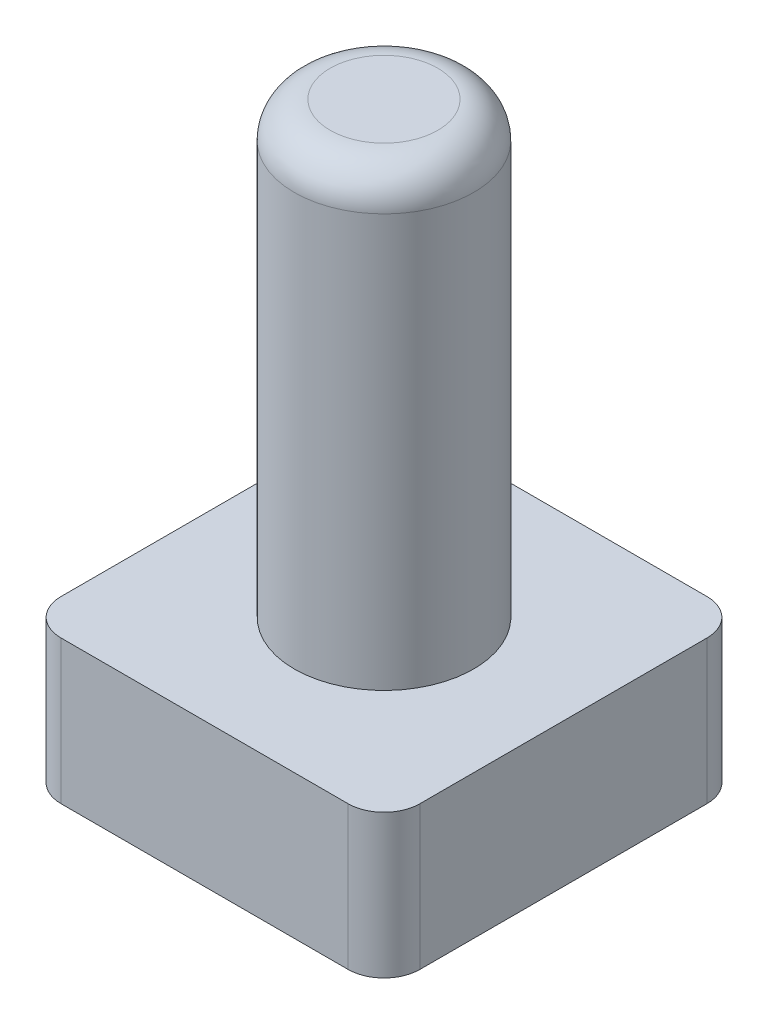
ISO-10303-21;
HEADER;
FILE_DESCRIPTION(('STEP AP214'),'2;1');
FILE_NAME('part.step','',(''),(''),'','','');
FILE_SCHEMA(('AUTOMOTIVE_DESIGN { 1 0 10303 214 1 1 1 1 }'));
ENDSEC;
DATA;
#1=APPLICATION_CONTEXT('core data for automotive mechanical design processes');
#2=APPLICATION_PROTOCOL_DEFINITION('international standard','automotive_design',2000,#1);
#3=PRODUCT_CONTEXT('',#1,'mechanical');
#4=PRODUCT('Part','Part','',(#3));
#5=PRODUCT_RELATED_PRODUCT_CATEGORY('part','',(#4));
#6=PRODUCT_DEFINITION_FORMATION('','',#4);
#7=PRODUCT_DEFINITION_CONTEXT('part definition',#1,'design');
#8=PRODUCT_DEFINITION('design','',#6,#7);
#9=PRODUCT_DEFINITION_SHAPE('','',#8);
#10=(LENGTH_UNIT() NAMED_UNIT(*) SI_UNIT(.MILLI.,.METRE.));
#11=(NAMED_UNIT(*) PLANE_ANGLE_UNIT() SI_UNIT($,.RADIAN.));
#12=(NAMED_UNIT(*) SI_UNIT($,.STERADIAN.) SOLID_ANGLE_UNIT());
#13=UNCERTAINTY_MEASURE_WITH_UNIT(LENGTH_MEASURE(1.E-05),#10,'distance_accuracy_value','');
#14=(GEOMETRIC_REPRESENTATION_CONTEXT(3) GLOBAL_UNCERTAINTY_ASSIGNED_CONTEXT((#13)) GLOBAL_UNIT_ASSIGNED_CONTEXT((#10,
#11,#12)) REPRESENTATION_CONTEXT('',''));
#15=CARTESIAN_POINT('',(0.,0.,0.));
#16=DIRECTION('',(0.,0.,1.));
#17=DIRECTION('',(1.,0.,0.));
#18=AXIS2_PLACEMENT_3D('',#15,#16,#17);
#19=CARTESIAN_POINT('',(0.,0.,0.));
#20=DIRECTION('',(0.,-1.,0.));
#21=DIRECTION('',(0.,0.,-1.));
#22=AXIS2_PLACEMENT_3D('',#19,#20,#21);
#23=PLANE('',#22);
#24=DIRECTION('',(0.,0.,1.));
#25=VECTOR('',#24,1.);
#26=CARTESIAN_POINT('',(0.,0.,0.));
#27=LINE('',#26,#25);
#28=CARTESIAN_POINT('',(0.,0.,-9.));
#29=VERTEX_POINT('',#28);
#30=CARTESIAN_POINT('',(0.,0.,-1.));
#31=VERTEX_POINT('',#30);
#32=EDGE_CURVE('E157',#29,#31,#27,.T.);
#33=ORIENTED_EDGE('',*,*,#32,.F.);
#34=CARTESIAN_POINT('',(1.,0.,-9.));
#35=DIRECTION('',(0.,-1.,0.));
#36=DIRECTION('',(0.,0.,-1.));
#37=AXIS2_PLACEMENT_3D('',#34,#35,#36);
#38=CIRCLE('',#37,1.);
#39=CARTESIAN_POINT('',(1.,0.,-10.));
#40=VERTEX_POINT('',#39);
#41=EDGE_CURVE('E196',#29,#40,#38,.T.);
#42=ORIENTED_EDGE('',*,*,#41,.T.);
#43=DIRECTION('',(-1.,0.,0.));
#44=VECTOR('',#43,1.);
#45=CARTESIAN_POINT('',(0.,0.,-10.));
#46=LINE('',#45,#44);
#47=CARTESIAN_POINT('',(9.,0.,-10.));
#48=VERTEX_POINT('',#47);
#49=EDGE_CURVE('E175',#48,#40,#46,.T.);
#50=ORIENTED_EDGE('',*,*,#49,.F.);
#51=CARTESIAN_POINT('',(9.,0.,-9.));
#52=DIRECTION('',(0.,-1.,0.));
#53=DIRECTION('',(0.,0.,-1.));
#54=AXIS2_PLACEMENT_3D('',#51,#52,#53);
#55=CIRCLE('',#54,1.);
#56=CARTESIAN_POINT('',(10.,0.,-9.));
#57=VERTEX_POINT('',#56);
#58=EDGE_CURVE('E193',#48,#57,#55,.T.);
#59=ORIENTED_EDGE('',*,*,#58,.T.);
#60=DIRECTION('',(0.,0.,-1.));
#61=VECTOR('',#60,1.);
#62=CARTESIAN_POINT('',(10.,0.,0.));
#63=LINE('',#62,#61);
#64=CARTESIAN_POINT('',(10.,0.,-1.));
#65=VERTEX_POINT('',#64);
#66=EDGE_CURVE('E172',#65,#57,#63,.T.);
#67=ORIENTED_EDGE('',*,*,#66,.F.);
#68=CARTESIAN_POINT('',(9.,0.,-1.));
#69=DIRECTION('',(0.,-1.,0.));
#70=DIRECTION('',(0.,0.,-1.));
#71=AXIS2_PLACEMENT_3D('',#68,#69,#70);
#72=CIRCLE('',#71,1.);
#73=CARTESIAN_POINT('',(9.,0.,0.));
#74=VERTEX_POINT('',#73);
#75=EDGE_CURVE('E190',#65,#74,#72,.T.);
#76=ORIENTED_EDGE('',*,*,#75,.T.);
#77=DIRECTION('',(1.,0.,0.));
#78=VECTOR('',#77,1.);
#79=CARTESIAN_POINT('',(0.,0.,0.));
#80=LINE('',#79,#78);
#81=CARTESIAN_POINT('',(1.,0.,0.));
#82=VERTEX_POINT('',#81);
#83=EDGE_CURVE('E163',#82,#74,#80,.T.);
#84=ORIENTED_EDGE('',*,*,#83,.F.);
#85=CARTESIAN_POINT('',(1.,0.,-1.));
#86=DIRECTION('',(0.,-1.,0.));
#87=DIRECTION('',(0.,0.,-1.));
#88=AXIS2_PLACEMENT_3D('',#85,#86,#87);
#89=CIRCLE('',#88,1.);
#90=EDGE_CURVE('E187',#82,#31,#89,.T.);
#91=ORIENTED_EDGE('',*,*,#90,.T.);
#92=EDGE_LOOP('',(#33,#42,#50,#59,#67,#76,#84,#91));
#93=FACE_BOUND('',#92,.T.);
#94=DIRECTION('',(-1.,0.,0.));
#95=VECTOR('',#94,1.);
#96=CARTESIAN_POINT('',(1.5,0.,-8.5));
#97=LINE('',#96,#95);
#98=CARTESIAN_POINT('',(8.5,0.,-8.5));
#99=VERTEX_POINT('',#98);
#100=CARTESIAN_POINT('',(1.5,0.,-8.5));
#101=VERTEX_POINT('',#100);
#102=EDGE_CURVE('E151',#99,#101,#97,.T.);
#103=ORIENTED_EDGE('',*,*,#102,.T.);
#104=DIRECTION('',(0.,0.,1.));
#105=VECTOR('',#104,1.);
#106=CARTESIAN_POINT('',(1.5,0.,-1.5));
#107=LINE('',#106,#105);
#108=CARTESIAN_POINT('',(1.5,0.,-1.5));
#109=VERTEX_POINT('',#108);
#110=EDGE_CURVE('E300',#101,#109,#107,.T.);
#111=ORIENTED_EDGE('',*,*,#110,.T.);
#112=DIRECTION('',(1.,0.,0.));
#113=VECTOR('',#112,1.);
#114=CARTESIAN_POINT('',(1.5,0.,-1.5));
#115=LINE('',#114,#113);
#116=CARTESIAN_POINT('',(8.5,0.,-1.5));
#117=VERTEX_POINT('',#116);
#118=EDGE_CURVE('E155',#109,#117,#115,.T.);
#119=ORIENTED_EDGE('',*,*,#118,.T.);
#120=DIRECTION('',(0.,0.,-1.));
#121=VECTOR('',#120,1.);
#122=CARTESIAN_POINT('',(8.5,0.,-1.5));
#123=LINE('',#122,#121);
#124=EDGE_CURVE('E315',#117,#99,#123,.T.);
#125=ORIENTED_EDGE('',*,*,#124,.T.);
#126=EDGE_LOOP('',(#103,#111,#119,#125));
#127=FACE_BOUND('',#126,.T.);
#128=ADVANCED_FACE('F39',(#93,#127),#23,.T.);
#129=CARTESIAN_POINT('',(0.,3.,0.));
#130=DIRECTION('',(1.,0.,0.));
#131=DIRECTION('',(0.,0.,-1.));
#132=AXIS2_PLACEMENT_3D('',#129,#130,#131);
#133=PLANE('',#132);
#134=DIRECTION('',(0.,0.,1.));
#135=VECTOR('',#134,1.);
#136=CARTESIAN_POINT('',(0.,4.,-10.));
#137=LINE('',#136,#135);
#138=CARTESIAN_POINT('',(0.,4.,-9.));
#139=VERTEX_POINT('',#138);
#140=CARTESIAN_POINT('',(0.,4.,-0.999999999999999));
#141=VERTEX_POINT('',#140);
#142=EDGE_CURVE('E295',#139,#141,#137,.T.);
#143=ORIENTED_EDGE('',*,*,#142,.F.);
#144=DIRECTION('',(0.,-1.,0.));
#145=VECTOR('',#144,1.);
#146=CARTESIAN_POINT('',(0.,3.,-9.));
#147=LINE('',#146,#145);
#148=EDGE_CURVE('E183',#139,#29,#147,.T.);
#149=ORIENTED_EDGE('',*,*,#148,.T.);
#150=ORIENTED_EDGE('',*,*,#32,.T.);
#151=DIRECTION('',(0.,-1.,0.));
#152=VECTOR('',#151,1.);
#153=CARTESIAN_POINT('',(0.,3.,-1.));
#154=LINE('',#153,#152);
#155=EDGE_CURVE('E180',#31,#141,#154,.F.);
#156=ORIENTED_EDGE('',*,*,#155,.T.);
#157=EDGE_LOOP('',(#143,#149,#150,#156));
#158=FACE_BOUND('',#157,.T.);
#159=ADVANCED_FACE('F245',(#158),#133,.F.);
#160=CARTESIAN_POINT('',(0.,3.,0.));
#161=DIRECTION('',(0.,0.,-1.));
#162=DIRECTION('',(-1.,0.,0.));
#163=AXIS2_PLACEMENT_3D('',#160,#161,#162);
#164=PLANE('',#163);
#165=ORIENTED_EDGE('',*,*,#83,.T.);
#166=DIRECTION('',(0.,-1.,0.));
#167=VECTOR('',#166,1.);
#168=CARTESIAN_POINT('',(9.,3.,0.));
#169=LINE('',#168,#167);
#170=CARTESIAN_POINT('',(9.,4.,0.));
#171=VERTEX_POINT('',#170);
#172=EDGE_CURVE('E227',#74,#171,#169,.F.);
#173=ORIENTED_EDGE('',*,*,#172,.T.);
#174=DIRECTION('',(1.,0.,0.));
#175=VECTOR('',#174,1.);
#176=CARTESIAN_POINT('',(0.,4.,0.));
#177=LINE('',#176,#175);
#178=CARTESIAN_POINT('',(1.,4.,0.));
#179=VERTEX_POINT('',#178);
#180=EDGE_CURVE('E302',#179,#171,#177,.T.);
#181=ORIENTED_EDGE('',*,*,#180,.F.);
#182=DIRECTION('',(0.,-1.,0.));
#183=VECTOR('',#182,1.);
#184=CARTESIAN_POINT('',(1.,3.,0.));
#185=LINE('',#184,#183);
#186=EDGE_CURVE('E223',#179,#82,#185,.T.);
#187=ORIENTED_EDGE('',*,*,#186,.T.);
#188=EDGE_LOOP('',(#165,#173,#181,#187));
#189=FACE_BOUND('',#188,.T.);
#190=ADVANCED_FACE('F251',(#189),#164,.F.);
#191=CARTESIAN_POINT('',(10.,3.,0.));
#192=DIRECTION('',(-1.,0.,0.));
#193=DIRECTION('',(0.,0.,1.));
#194=AXIS2_PLACEMENT_3D('',#191,#192,#193);
#195=PLANE('',#194);
#196=ORIENTED_EDGE('',*,*,#66,.T.);
#197=DIRECTION('',(0.,-1.,0.));
#198=VECTOR('',#197,1.);
#199=CARTESIAN_POINT('',(10.,3.,-9.));
#200=LINE('',#199,#198);
#201=CARTESIAN_POINT('',(10.,4.,-9.));
#202=VERTEX_POINT('',#201);
#203=EDGE_CURVE('E55',#57,#202,#200,.F.);
#204=ORIENTED_EDGE('',*,*,#203,.T.);
#205=DIRECTION('',(0.,0.,-1.));
#206=VECTOR('',#205,1.);
#207=CARTESIAN_POINT('',(10.,4.,0.));
#208=LINE('',#207,#206);
#209=CARTESIAN_POINT('',(10.,4.,-1.));
#210=VERTEX_POINT('',#209);
#211=EDGE_CURVE('E284',#210,#202,#208,.T.);
#212=ORIENTED_EDGE('',*,*,#211,.F.);
#213=DIRECTION('',(0.,-1.,0.));
#214=VECTOR('',#213,1.);
#215=CARTESIAN_POINT('',(10.,3.,-1.));
#216=LINE('',#215,#214);
#217=EDGE_CURVE('E217',#210,#65,#216,.T.);
#218=ORIENTED_EDGE('',*,*,#217,.T.);
#219=EDGE_LOOP('',(#196,#204,#212,#218));
#220=FACE_BOUND('',#219,.T.);
#221=ADVANCED_FACE('F262',(#220),#195,.F.);
#222=CARTESIAN_POINT('',(0.,3.,-10.));
#223=DIRECTION('',(0.,0.,1.));
#224=DIRECTION('',(1.,0.,0.));
#225=AXIS2_PLACEMENT_3D('',#222,#223,#224);
#226=PLANE('',#225);
#227=ORIENTED_EDGE('',*,*,#49,.T.);
#228=DIRECTION('',(0.,-1.,0.));
#229=VECTOR('',#228,1.);
#230=CARTESIAN_POINT('',(1.,3.,-10.));
#231=LINE('',#230,#229);
#232=CARTESIAN_POINT('',(1.,4.,-10.));
#233=VERTEX_POINT('',#232);
#234=EDGE_CURVE('E203',#40,#233,#231,.F.);
#235=ORIENTED_EDGE('',*,*,#234,.T.);
#236=DIRECTION('',(-1.,0.,0.));
#237=VECTOR('',#236,1.);
#238=CARTESIAN_POINT('',(10.,4.,-10.));
#239=LINE('',#238,#237);
#240=CARTESIAN_POINT('',(9.,4.,-10.));
#241=VERTEX_POINT('',#240);
#242=EDGE_CURVE('E292',#241,#233,#239,.T.);
#243=ORIENTED_EDGE('',*,*,#242,.F.);
#244=DIRECTION('',(0.,-1.,0.));
#245=VECTOR('',#244,1.);
#246=CARTESIAN_POINT('',(9.,3.,-10.));
#247=LINE('',#246,#245);
#248=EDGE_CURVE('E199',#241,#48,#247,.T.);
#249=ORIENTED_EDGE('',*,*,#248,.T.);
#250=EDGE_LOOP('',(#227,#235,#243,#249));
#251=FACE_BOUND('',#250,.T.);
#252=ADVANCED_FACE('F259',(#251),#226,.F.);
#253=CARTESIAN_POINT('',(1.5,3.,-1.5));
#254=DIRECTION('',(1.,0.,0.));
#255=DIRECTION('',(0.,0.,-1.));
#256=AXIS2_PLACEMENT_3D('',#253,#254,#255);
#257=PLANE('',#256);
#258=ORIENTED_EDGE('',*,*,#110,.F.);
#259=DIRECTION('',(0.,-1.,0.));
#260=VECTOR('',#259,1.);
#261=CARTESIAN_POINT('',(1.5,3.,-8.5));
#262=LINE('',#261,#260);
#263=CARTESIAN_POINT('',(1.5,3.,-8.5));
#264=VERTEX_POINT('',#263);
#265=EDGE_CURVE('E149',#264,#101,#262,.T.);
#266=ORIENTED_EDGE('',*,*,#265,.F.);
#267=DIRECTION('',(0.,0.,1.));
#268=VECTOR('',#267,1.);
#269=CARTESIAN_POINT('',(1.5,3.,-1.5));
#270=LINE('',#269,#268);
#271=CARTESIAN_POINT('',(1.5,3.,-1.5));
#272=VERTEX_POINT('',#271);
#273=EDGE_CURVE('E133',#264,#272,#270,.T.);
#274=ORIENTED_EDGE('',*,*,#273,.T.);
#275=DIRECTION('',(0.,-1.,0.));
#276=VECTOR('',#275,1.);
#277=CARTESIAN_POINT('',(1.5,3.,-1.5));
#278=LINE('',#277,#276);
#279=EDGE_CURVE('E146',#272,#109,#278,.T.);
#280=ORIENTED_EDGE('',*,*,#279,.T.);
#281=EDGE_LOOP('',(#258,#266,#274,#280));
#282=FACE_BOUND('',#281,.T.);
#283=ADVANCED_FACE('F145',(#282),#257,.T.);
#284=CARTESIAN_POINT('',(1.5,3.,-1.5));
#285=DIRECTION('',(0.,0.,-1.));
#286=DIRECTION('',(-1.,0.,0.));
#287=AXIS2_PLACEMENT_3D('',#284,#285,#286);
#288=PLANE('',#287);
#289=ORIENTED_EDGE('',*,*,#118,.F.);
#290=ORIENTED_EDGE('',*,*,#279,.F.);
#291=DIRECTION('',(1.,0.,0.));
#292=VECTOR('',#291,1.);
#293=CARTESIAN_POINT('',(1.5,3.,-1.5));
#294=LINE('',#293,#292);
#295=CARTESIAN_POINT('',(8.5,3.,-1.5));
#296=VERTEX_POINT('',#295);
#297=EDGE_CURVE('E130',#272,#296,#294,.T.);
#298=ORIENTED_EDGE('',*,*,#297,.T.);
#299=DIRECTION('',(0.,-1.,0.));
#300=VECTOR('',#299,1.);
#301=CARTESIAN_POINT('',(8.5,3.,-1.5));
#302=LINE('',#301,#300);
#303=EDGE_CURVE('E158',#296,#117,#302,.T.);
#304=ORIENTED_EDGE('',*,*,#303,.T.);
#305=EDGE_LOOP('',(#289,#290,#298,#304));
#306=FACE_BOUND('',#305,.T.);
#307=ADVANCED_FACE('F153',(#306),#288,.T.);
#308=CARTESIAN_POINT('',(8.5,3.,-1.5));
#309=DIRECTION('',(-1.,0.,0.));
#310=DIRECTION('',(0.,0.,1.));
#311=AXIS2_PLACEMENT_3D('',#308,#309,#310);
#312=PLANE('',#311);
#313=ORIENTED_EDGE('',*,*,#124,.F.);
#314=ORIENTED_EDGE('',*,*,#303,.F.);
#315=DIRECTION('',(0.,0.,-1.));
#316=VECTOR('',#315,1.);
#317=CARTESIAN_POINT('',(8.5,3.,-1.5));
#318=LINE('',#317,#316);
#319=CARTESIAN_POINT('',(8.5,3.,-8.5));
#320=VERTEX_POINT('',#319);
#321=EDGE_CURVE('E136',#296,#320,#318,.T.);
#322=ORIENTED_EDGE('',*,*,#321,.T.);
#323=DIRECTION('',(0.,-1.,0.));
#324=VECTOR('',#323,1.);
#325=CARTESIAN_POINT('',(8.5,3.,-8.5));
#326=LINE('',#325,#324);
#327=EDGE_CURVE('E165',#320,#99,#326,.T.);
#328=ORIENTED_EDGE('',*,*,#327,.T.);
#329=EDGE_LOOP('',(#313,#314,#322,#328));
#330=FACE_BOUND('',#329,.T.);
#331=ADVANCED_FACE('F328',(#330),#312,.T.);
#332=CARTESIAN_POINT('',(1.5,3.,-8.5));
#333=DIRECTION('',(0.,0.,1.));
#334=DIRECTION('',(1.,0.,0.));
#335=AXIS2_PLACEMENT_3D('',#332,#333,#334);
#336=PLANE('',#335);
#337=ORIENTED_EDGE('',*,*,#102,.F.);
#338=ORIENTED_EDGE('',*,*,#327,.F.);
#339=DIRECTION('',(-1.,0.,0.));
#340=VECTOR('',#339,1.);
#341=CARTESIAN_POINT('',(1.5,3.,-8.5));
#342=LINE('',#341,#340);
#343=EDGE_CURVE('E308',#320,#264,#342,.T.);
#344=ORIENTED_EDGE('',*,*,#343,.T.);
#345=ORIENTED_EDGE('',*,*,#265,.T.);
#346=EDGE_LOOP('',(#337,#338,#344,#345));
#347=FACE_BOUND('',#346,.T.);
#348=ADVANCED_FACE('F330',(#347),#336,.T.);
#349=CARTESIAN_POINT('',(0.,3.,0.));
#350=DIRECTION('',(0.,1.,0.));
#351=DIRECTION('',(0.,0.,1.));
#352=AXIS2_PLACEMENT_3D('',#349,#350,#351);
#353=PLANE('',#352);
#354=ORIENTED_EDGE('',*,*,#273,.F.);
#355=ORIENTED_EDGE('',*,*,#343,.F.);
#356=ORIENTED_EDGE('',*,*,#321,.F.);
#357=ORIENTED_EDGE('',*,*,#297,.F.);
#358=EDGE_LOOP('',(#354,#355,#356,#357));
#359=FACE_BOUND('',#358,.T.);
#360=ADVANCED_FACE('F132',(#359),#353,.F.);
#361=CARTESIAN_POINT('',(0.,4.,0.));
#362=DIRECTION('',(0.,1.,0.));
#363=DIRECTION('',(0.,0.,1.));
#364=AXIS2_PLACEMENT_3D('',#361,#362,#363);
#365=PLANE('',#364);
#366=CARTESIAN_POINT('',(5.,4.,-5.));
#367=DIRECTION('',(0.,1.,0.));
#368=DIRECTION('',(0.,0.,1.));
#369=AXIS2_PLACEMENT_3D('',#366,#367,#368);
#370=CIRCLE('',#369,2.5);
#371=CARTESIAN_POINT('',(5.,4.,-2.5));
#372=VERTEX_POINT('',#371);
#373=EDGE_CURVE('E179',#372,#372,#370,.T.);
#374=ORIENTED_EDGE('',*,*,#373,.F.);
#375=EDGE_LOOP('',(#374));
#376=FACE_BOUND('',#375,.T.);
#377=ORIENTED_EDGE('',*,*,#242,.T.);
#378=CARTESIAN_POINT('',(1.,4.,-9.));
#379=DIRECTION('',(0.,1.,0.));
#380=DIRECTION('',(0.,0.,1.));
#381=AXIS2_PLACEMENT_3D('',#378,#379,#380);
#382=CIRCLE('',#381,1.);
#383=EDGE_CURVE('E214',#233,#139,#382,.T.);
#384=ORIENTED_EDGE('',*,*,#383,.T.);
#385=ORIENTED_EDGE('',*,*,#142,.T.);
#386=CARTESIAN_POINT('',(1.,4.,-1.));
#387=DIRECTION('',(0.,1.,0.));
#388=DIRECTION('',(0.,0.,1.));
#389=AXIS2_PLACEMENT_3D('',#386,#387,#388);
#390=CIRCLE('',#389,1.);
#391=EDGE_CURVE('E206',#141,#179,#390,.T.);
#392=ORIENTED_EDGE('',*,*,#391,.T.);
#393=ORIENTED_EDGE('',*,*,#180,.T.);
#394=CARTESIAN_POINT('',(9.,4.,-1.));
#395=DIRECTION('',(0.,1.,0.));
#396=DIRECTION('',(0.,0.,1.));
#397=AXIS2_PLACEMENT_3D('',#394,#395,#396);
#398=CIRCLE('',#397,1.);
#399=EDGE_CURVE('E62',#171,#210,#398,.T.);
#400=ORIENTED_EDGE('',*,*,#399,.T.);
#401=ORIENTED_EDGE('',*,*,#211,.T.);
#402=CARTESIAN_POINT('',(9.,4.,-9.));
#403=DIRECTION('',(0.,1.,0.));
#404=DIRECTION('',(0.,0.,1.));
#405=AXIS2_PLACEMENT_3D('',#402,#403,#404);
#406=CIRCLE('',#405,1.);
#407=EDGE_CURVE('E211',#202,#241,#406,.T.);
#408=ORIENTED_EDGE('',*,*,#407,.T.);
#409=EDGE_LOOP('',(#377,#384,#385,#392,#393,#400,#401,#408));
#410=FACE_BOUND('',#409,.T.);
#411=ADVANCED_FACE('F337',(#376,#410),#365,.T.);
#412=CARTESIAN_POINT('',(5.,16.5,-5.));
#413=DIRECTION('',(0.,-1.,0.));
#414=DIRECTION('',(0.,0.,-1.));
#415=AXIS2_PLACEMENT_3D('',#412,#413,#414);
#416=CYLINDRICAL_SURFACE('',#415,2.5);
#417=CARTESIAN_POINT('',(5.,15.5,-5.));
#418=DIRECTION('',(0.,1.,0.));
#419=DIRECTION('',(0.,0.,1.));
#420=AXIS2_PLACEMENT_3D('',#417,#418,#419);
#421=CIRCLE('',#420,2.5);
#422=CARTESIAN_POINT('',(5.,15.5,-2.5));
#423=VERTEX_POINT('',#422);
#424=EDGE_CURVE('E11',#423,#423,#421,.F.);
#425=ORIENTED_EDGE('',*,*,#424,.T.);
#426=EDGE_LOOP('',(#425));
#427=FACE_BOUND('',#426,.T.);
#428=ORIENTED_EDGE('',*,*,#373,.T.);
#429=EDGE_LOOP('',(#428));
#430=FACE_BOUND('',#429,.T.);
#431=ADVANCED_FACE('F416',(#427,#430),#416,.T.);
#432=CARTESIAN_POINT('',(5.,16.5,-5.));
#433=DIRECTION('',(0.,1.,0.));
#434=DIRECTION('',(0.,0.,1.));
#435=AXIS2_PLACEMENT_3D('',#432,#433,#434);
#436=PLANE('',#435);
#437=CARTESIAN_POINT('',(5.,16.5,-5.));
#438=DIRECTION('',(0.,1.,0.));
#439=DIRECTION('',(0.,0.,1.));
#440=AXIS2_PLACEMENT_3D('',#437,#438,#439);
#441=CIRCLE('',#440,1.5);
#442=CARTESIAN_POINT('',(5.,16.5,-3.5));
#443=VERTEX_POINT('',#442);
#444=EDGE_CURVE('E48',#443,#443,#441,.T.);
#445=ORIENTED_EDGE('',*,*,#444,.T.);
#446=EDGE_LOOP('',(#445));
#447=FACE_BOUND('',#446,.T.);
#448=ADVANCED_FACE('F233',(#447),#436,.T.);
#449=CARTESIAN_POINT('',(1.,3.,-9.));
#450=DIRECTION('',(0.,-1.,0.));
#451=DIRECTION('',(0.,0.,-1.));
#452=AXIS2_PLACEMENT_3D('',#449,#450,#451);
#453=CYLINDRICAL_SURFACE('',#452,1.);
#454=ORIENTED_EDGE('',*,*,#383,.F.);
#455=ORIENTED_EDGE('',*,*,#234,.F.);
#456=ORIENTED_EDGE('',*,*,#41,.F.);
#457=ORIENTED_EDGE('',*,*,#148,.F.);
#458=EDGE_LOOP('',(#454,#455,#456,#457));
#459=FACE_BOUND('',#458,.T.);
#460=ADVANCED_FACE('F269',(#459),#453,.T.);
#461=CARTESIAN_POINT('',(9.,3.,-9.));
#462=DIRECTION('',(0.,-1.,0.));
#463=DIRECTION('',(0.,0.,-1.));
#464=AXIS2_PLACEMENT_3D('',#461,#462,#463);
#465=CYLINDRICAL_SURFACE('',#464,1.);
#466=ORIENTED_EDGE('',*,*,#407,.F.);
#467=ORIENTED_EDGE('',*,*,#203,.F.);
#468=ORIENTED_EDGE('',*,*,#58,.F.);
#469=ORIENTED_EDGE('',*,*,#248,.F.);
#470=EDGE_LOOP('',(#466,#467,#468,#469));
#471=FACE_BOUND('',#470,.T.);
#472=ADVANCED_FACE('F272',(#471),#465,.T.);
#473=CARTESIAN_POINT('',(9.,3.,-1.));
#474=DIRECTION('',(0.,-1.,0.));
#475=DIRECTION('',(0.,0.,-1.));
#476=AXIS2_PLACEMENT_3D('',#473,#474,#475);
#477=CYLINDRICAL_SURFACE('',#476,1.);
#478=ORIENTED_EDGE('',*,*,#399,.F.);
#479=ORIENTED_EDGE('',*,*,#172,.F.);
#480=ORIENTED_EDGE('',*,*,#75,.F.);
#481=ORIENTED_EDGE('',*,*,#217,.F.);
#482=EDGE_LOOP('',(#478,#479,#480,#481));
#483=FACE_BOUND('',#482,.T.);
#484=ADVANCED_FACE('F241',(#483),#477,.T.);
#485=CARTESIAN_POINT('',(1.,3.,-1.));
#486=DIRECTION('',(0.,-1.,0.));
#487=DIRECTION('',(0.,0.,-1.));
#488=AXIS2_PLACEMENT_3D('',#485,#486,#487);
#489=CYLINDRICAL_SURFACE('',#488,1.);
#490=ORIENTED_EDGE('',*,*,#391,.F.);
#491=ORIENTED_EDGE('',*,*,#155,.F.);
#492=ORIENTED_EDGE('',*,*,#90,.F.);
#493=ORIENTED_EDGE('',*,*,#186,.F.);
#494=EDGE_LOOP('',(#490,#491,#492,#493));
#495=FACE_BOUND('',#494,.T.);
#496=ADVANCED_FACE('F236',(#495),#489,.T.);
#497=CARTESIAN_POINT('',(5.,15.5,-5.));
#498=DIRECTION('',(0.,1.,0.));
#499=DIRECTION('',(0.,0.,1.));
#500=AXIS2_PLACEMENT_3D('',#497,#498,#499);
#501=TOROIDAL_SURFACE('',#500,1.5,1.);
#502=ORIENTED_EDGE('',*,*,#424,.F.);
#503=EDGE_LOOP('',(#502));
#504=FACE_BOUND('',#503,.T.);
#505=ORIENTED_EDGE('',*,*,#444,.F.);
#506=EDGE_LOOP('',(#505));
#507=FACE_BOUND('',#506,.T.);
#508=ADVANCED_FACE('F41',(#504,#507),#501,.T.);
#509=CLOSED_SHELL('',(#128,#159,#190,#221,#252,#283,#307,#331,#348,#360,#411,#431,#448,#460,
#472,#484,#496,#508));
#510=MANIFOLD_SOLID_BREP('B2',#509);
#511=ADVANCED_BREP_SHAPE_REPRESENTATION('',(#18,#510),#14);
#512=SHAPE_DEFINITION_REPRESENTATION(#9,#511);
ENDSEC;
END-ISO-10303-21;
